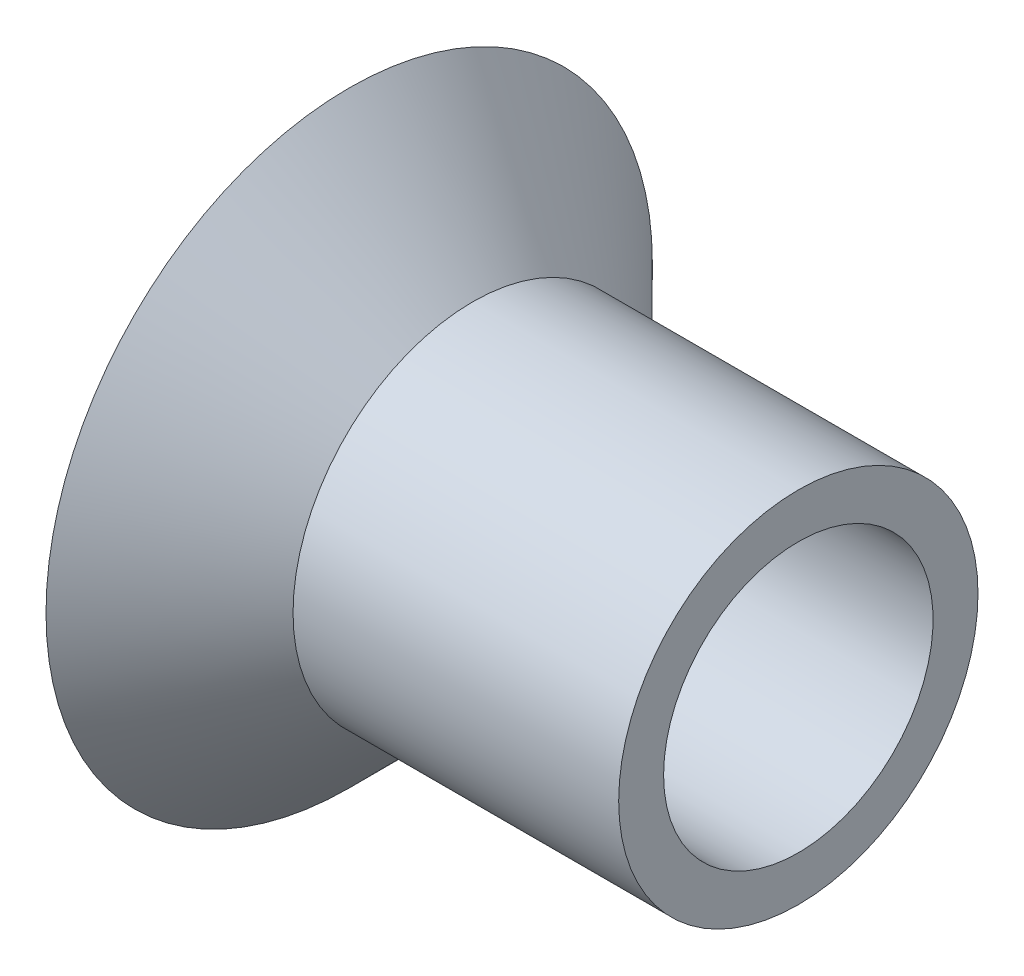
ISO-10303-21;
HEADER;
FILE_DESCRIPTION(('STEP AP214'),'2;1');
FILE_NAME('part.step','',(''),(''),'','','');
FILE_SCHEMA(('AUTOMOTIVE_DESIGN { 1 0 10303 214 1 1 1 1 }'));
ENDSEC;
DATA;
#1=APPLICATION_CONTEXT('core data for automotive mechanical design processes');
#2=APPLICATION_PROTOCOL_DEFINITION('international standard','automotive_design',2000,#1);
#3=PRODUCT_CONTEXT('',#1,'mechanical');
#4=PRODUCT('Part','Part','',(#3));
#5=PRODUCT_RELATED_PRODUCT_CATEGORY('part','',(#4));
#6=PRODUCT_DEFINITION_FORMATION('','',#4);
#7=PRODUCT_DEFINITION_CONTEXT('part definition',#1,'design');
#8=PRODUCT_DEFINITION('design','',#6,#7);
#9=PRODUCT_DEFINITION_SHAPE('','',#8);
#10=(LENGTH_UNIT() NAMED_UNIT(*) SI_UNIT(.MILLI.,.METRE.));
#11=(NAMED_UNIT(*) PLANE_ANGLE_UNIT() SI_UNIT($,.RADIAN.));
#12=(NAMED_UNIT(*) SI_UNIT($,.STERADIAN.) SOLID_ANGLE_UNIT());
#13=UNCERTAINTY_MEASURE_WITH_UNIT(LENGTH_MEASURE(1.E-05),#10,'distance_accuracy_value','');
#14=(GEOMETRIC_REPRESENTATION_CONTEXT(3) GLOBAL_UNCERTAINTY_ASSIGNED_CONTEXT((#13)) GLOBAL_UNIT_ASSIGNED_CONTEXT((#10,
#11,#12)) REPRESENTATION_CONTEXT('',''));
#15=CARTESIAN_POINT('',(0.,0.,0.));
#16=DIRECTION('',(0.,0.,1.));
#17=DIRECTION('',(1.,0.,0.));
#18=AXIS2_PLACEMENT_3D('',#15,#16,#17);
#19=CARTESIAN_POINT('',(5.,3.99999999999999,0.));
#20=DIRECTION('',(-1.,0.,0.));
#21=DIRECTION('',(0.,0.,1.));
#22=AXIS2_PLACEMENT_3D('',#19,#20,#21);
#23=PLANE('',#22);
#24=CARTESIAN_POINT('',(5.,0.,0.));
#25=DIRECTION('',(-1.,0.,0.));
#26=DIRECTION('',(0.,0.,1.));
#27=AXIS2_PLACEMENT_3D('',#24,#25,#26);
#28=CIRCLE('',#27,3.99999999999999);
#29=CARTESIAN_POINT('',(5.,0.,3.99999999999999));
#30=VERTEX_POINT('',#29);
#31=EDGE_CURVE('E53',#30,#30,#28,.T.);
#32=ORIENTED_EDGE('',*,*,#31,.F.);
#33=EDGE_LOOP('',(#32));
#34=FACE_BOUND('',#33,.T.);
#35=CARTESIAN_POINT('',(5.,0.,0.));
#36=DIRECTION('',(-1.,0.,0.));
#37=DIRECTION('',(0.,0.,1.));
#38=AXIS2_PLACEMENT_3D('',#35,#36,#37);
#39=CIRCLE('',#38,2.99999999999999);
#40=CARTESIAN_POINT('',(5.,0.,2.99999999999999));
#41=VERTEX_POINT('',#40);
#42=EDGE_CURVE('E10',#41,#41,#39,.T.);
#43=ORIENTED_EDGE('',*,*,#42,.T.);
#44=EDGE_LOOP('',(#43));
#45=FACE_BOUND('',#44,.T.);
#46=ADVANCED_FACE('F31',(#34,#45),#23,.F.);
#47=CARTESIAN_POINT('',(-9.57962245942667,0.,0.));
#48=DIRECTION('',(-1.,0.,0.));
#49=DIRECTION('',(0.,0.,1.));
#50=AXIS2_PLACEMENT_3D('',#47,#48,#49);
#51=CYLINDRICAL_SURFACE('',#50,3.);
#52=ORIENTED_EDGE('',*,*,#42,.F.);
#53=EDGE_LOOP('',(#52));
#54=FACE_BOUND('',#53,.T.);
#55=CARTESIAN_POINT('',(-2.66421356237313,0.,0.));
#56=DIRECTION('',(-1.,0.,0.));
#57=DIRECTION('',(0.,0.,1.));
#58=AXIS2_PLACEMENT_3D('',#55,#56,#57);
#59=CIRCLE('',#58,3.);
#60=CARTESIAN_POINT('',(-2.66421356237313,0.,3.));
#61=VERTEX_POINT('',#60);
#62=EDGE_CURVE('E37',#61,#61,#59,.T.);
#63=ORIENTED_EDGE('',*,*,#62,.T.);
#64=EDGE_LOOP('',(#63));
#65=FACE_BOUND('',#64,.T.);
#66=ADVANCED_FACE('F60',(#54,#65),#51,.F.);
#67=CARTESIAN_POINT('',(-5.,0.,0.));
#68=DIRECTION('',(-1.,0.,0.));
#69=DIRECTION('',(0.,0.,1.));
#70=AXIS2_PLACEMENT_3D('',#67,#68,#69);
#71=CONICAL_SURFACE('',#70,5.3357864376269,0.785398163397453);
#72=ORIENTED_EDGE('',*,*,#62,.F.);
#73=EDGE_LOOP('',(#72));
#74=FACE_BOUND('',#73,.T.);
#75=CARTESIAN_POINT('',(-5.,0.,0.));
#76=DIRECTION('',(-1.,0.,0.));
#77=DIRECTION('',(0.,0.,1.));
#78=AXIS2_PLACEMENT_3D('',#75,#76,#77);
#79=CIRCLE('',#78,5.3357864376269);
#80=CARTESIAN_POINT('',(-5.,0.,5.3357864376269));
#81=VERTEX_POINT('',#80);
#82=EDGE_CURVE('E41',#81,#81,#79,.T.);
#83=ORIENTED_EDGE('',*,*,#82,.T.);
#84=EDGE_LOOP('',(#83));
#85=FACE_BOUND('',#84,.T.);
#86=ADVANCED_FACE('F64',(#74,#85),#71,.F.);
#87=CARTESIAN_POINT('',(-5.,6.75,0.));
#88=DIRECTION('',(1.,0.,0.));
#89=DIRECTION('',(0.,0.,-1.));
#90=AXIS2_PLACEMENT_3D('',#87,#88,#89);
#91=PLANE('',#90);
#92=ORIENTED_EDGE('',*,*,#82,.F.);
#93=EDGE_LOOP('',(#92));
#94=FACE_BOUND('',#93,.T.);
#95=CARTESIAN_POINT('',(-5.,0.,0.));
#96=DIRECTION('',(-1.,0.,0.));
#97=DIRECTION('',(0.,0.,1.));
#98=AXIS2_PLACEMENT_3D('',#95,#96,#97);
#99=CIRCLE('',#98,6.75);
#100=CARTESIAN_POINT('',(-5.,0.,6.75));
#101=VERTEX_POINT('',#100);
#102=EDGE_CURVE('E45',#101,#101,#99,.T.);
#103=ORIENTED_EDGE('',*,*,#102,.T.);
#104=EDGE_LOOP('',(#103));
#105=FACE_BOUND('',#104,.T.);
#106=ADVANCED_FACE('F69',(#94,#105),#91,.F.);
#107=CARTESIAN_POINT('',(-2.25000000000003,0.,0.));
#108=DIRECTION('',(-1.,0.,0.));
#109=DIRECTION('',(0.,0.,1.));
#110=AXIS2_PLACEMENT_3D('',#107,#108,#109);
#111=CONICAL_SURFACE('',#110,4.,0.785398163397453);
#112=ORIENTED_EDGE('',*,*,#102,.F.);
#113=EDGE_LOOP('',(#112));
#114=FACE_BOUND('',#113,.T.);
#115=CARTESIAN_POINT('',(-2.25000000000003,0.,0.));
#116=DIRECTION('',(-1.,0.,0.));
#117=DIRECTION('',(0.,0.,1.));
#118=AXIS2_PLACEMENT_3D('',#115,#116,#117);
#119=CIRCLE('',#118,4.);
#120=CARTESIAN_POINT('',(-2.25000000000003,0.,4.));
#121=VERTEX_POINT('',#120);
#122=EDGE_CURVE('E50',#121,#121,#119,.T.);
#123=ORIENTED_EDGE('',*,*,#122,.T.);
#124=EDGE_LOOP('',(#123));
#125=FACE_BOUND('',#124,.T.);
#126=ADVANCED_FACE('F75',(#114,#125),#111,.T.);
#127=CARTESIAN_POINT('',(-9.57962245942667,0.,0.));
#128=DIRECTION('',(-1.,0.,0.));
#129=DIRECTION('',(0.,0.,1.));
#130=AXIS2_PLACEMENT_3D('',#127,#128,#129);
#131=CYLINDRICAL_SURFACE('',#130,4.);
#132=ORIENTED_EDGE('',*,*,#122,.F.);
#133=EDGE_LOOP('',(#132));
#134=FACE_BOUND('',#133,.T.);
#135=ORIENTED_EDGE('',*,*,#31,.T.);
#136=EDGE_LOOP('',(#135));
#137=FACE_BOUND('',#136,.T.);
#138=ADVANCED_FACE('F57',(#134,#137),#131,.T.);
#139=CLOSED_SHELL('',(#46,#66,#86,#106,#126,#138));
#140=MANIFOLD_SOLID_BREP('B2',#139);
#141=ADVANCED_BREP_SHAPE_REPRESENTATION('',(#18,#140),#14);
#142=SHAPE_DEFINITION_REPRESENTATION(#9,#141);
ENDSEC;
END-ISO-10303-21;
